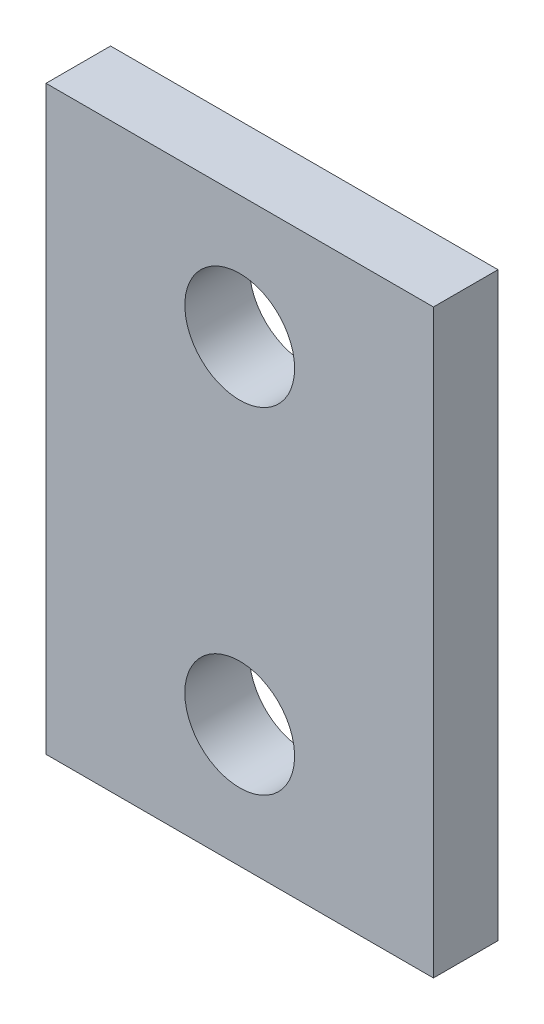
ISO-10303-21;
HEADER;
FILE_DESCRIPTION(('STEP AP214'),'2;1');
FILE_NAME('part.step','',(''),(''),'','','');
FILE_SCHEMA(('AUTOMOTIVE_DESIGN { 1 0 10303 214 1 1 1 1 }'));
ENDSEC;
DATA;
#1=APPLICATION_CONTEXT('core data for automotive mechanical design processes');
#2=APPLICATION_PROTOCOL_DEFINITION('international standard','automotive_design',2000,#1);
#3=PRODUCT_CONTEXT('',#1,'mechanical');
#4=PRODUCT('Part','Part','',(#3));
#5=PRODUCT_RELATED_PRODUCT_CATEGORY('part','',(#4));
#6=PRODUCT_DEFINITION_FORMATION('','',#4);
#7=PRODUCT_DEFINITION_CONTEXT('part definition',#1,'design');
#8=PRODUCT_DEFINITION('design','',#6,#7);
#9=PRODUCT_DEFINITION_SHAPE('','',#8);
#10=(LENGTH_UNIT() NAMED_UNIT(*) SI_UNIT(.MILLI.,.METRE.));
#11=(NAMED_UNIT(*) PLANE_ANGLE_UNIT() SI_UNIT($,.RADIAN.));
#12=(NAMED_UNIT(*) SI_UNIT($,.STERADIAN.) SOLID_ANGLE_UNIT());
#13=UNCERTAINTY_MEASURE_WITH_UNIT(LENGTH_MEASURE(1.E-05),#10,'distance_accuracy_value','');
#14=(GEOMETRIC_REPRESENTATION_CONTEXT(3) GLOBAL_UNCERTAINTY_ASSIGNED_CONTEXT((#13)) GLOBAL_UNIT_ASSIGNED_CONTEXT((#10,
#11,#12)) REPRESENTATION_CONTEXT('',''));
#15=CARTESIAN_POINT('',(0.,0.,0.));
#16=DIRECTION('',(0.,0.,1.));
#17=DIRECTION('',(1.,0.,0.));
#18=AXIS2_PLACEMENT_3D('',#15,#16,#17);
#19=CARTESIAN_POINT('',(0.,0.,5.));
#20=DIRECTION('',(0.,0.,-1.));
#21=DIRECTION('',(-1.,0.,0.));
#22=AXIS2_PLACEMENT_3D('',#19,#20,#21);
#23=PLANE('',#22);
#24=DIRECTION('',(0.,-1.,0.));
#25=VECTOR('',#24,1.);
#26=CARTESIAN_POINT('',(-15.,22.5,5.));
#27=LINE('',#26,#25);
#28=CARTESIAN_POINT('',(-15.,22.5,5.));
#29=VERTEX_POINT('',#28);
#30=CARTESIAN_POINT('',(-15.,-22.5,5.));
#31=VERTEX_POINT('',#30);
#32=EDGE_CURVE('E87',#29,#31,#27,.T.);
#33=ORIENTED_EDGE('',*,*,#32,.T.);
#34=DIRECTION('',(1.,0.,0.));
#35=VECTOR('',#34,1.);
#36=CARTESIAN_POINT('',(15.,-22.5,5.));
#37=LINE('',#36,#35);
#38=CARTESIAN_POINT('',(15.,-22.5,5.));
#39=VERTEX_POINT('',#38);
#40=EDGE_CURVE('E82',#31,#39,#37,.T.);
#41=ORIENTED_EDGE('',*,*,#40,.T.);
#42=DIRECTION('',(0.,1.,0.));
#43=VECTOR('',#42,1.);
#44=CARTESIAN_POINT('',(15.,22.5,5.));
#45=LINE('',#44,#43);
#46=CARTESIAN_POINT('',(15.,22.5,5.));
#47=VERTEX_POINT('',#46);
#48=EDGE_CURVE('E85',#39,#47,#45,.T.);
#49=ORIENTED_EDGE('',*,*,#48,.T.);
#50=DIRECTION('',(-1.,0.,0.));
#51=VECTOR('',#50,1.);
#52=CARTESIAN_POINT('',(15.,22.5,5.));
#53=LINE('',#52,#51);
#54=EDGE_CURVE('E52',#47,#29,#53,.T.);
#55=ORIENTED_EDGE('',*,*,#54,.T.);
#56=EDGE_LOOP('',(#33,#41,#49,#55));
#57=FACE_BOUND('',#56,.T.);
#58=CARTESIAN_POINT('',(0.,13.,5.));
#59=DIRECTION('',(0.,0.,1.));
#60=DIRECTION('',(1.,0.,0.));
#61=AXIS2_PLACEMENT_3D('',#58,#59,#60);
#62=CIRCLE('',#61,4.25);
#63=CARTESIAN_POINT('',(4.25,13.,5.));
#64=VERTEX_POINT('',#63);
#65=EDGE_CURVE('E102',#64,#64,#62,.T.);
#66=ORIENTED_EDGE('',*,*,#65,.F.);
#67=EDGE_LOOP('',(#66));
#68=FACE_BOUND('',#67,.T.);
#69=CARTESIAN_POINT('',(0.,-13.,5.));
#70=DIRECTION('',(0.,0.,1.));
#71=DIRECTION('',(-1.,0.,0.));
#72=AXIS2_PLACEMENT_3D('',#69,#70,#71);
#73=CIRCLE('',#72,4.25);
#74=CARTESIAN_POINT('',(-4.25,-13.,5.));
#75=VERTEX_POINT('',#74);
#76=EDGE_CURVE('E117',#75,#75,#73,.T.);
#77=ORIENTED_EDGE('',*,*,#76,.F.);
#78=EDGE_LOOP('',(#77));
#79=FACE_BOUND('',#78,.T.);
#80=ADVANCED_FACE('F35',(#57,#68,#79),#23,.F.);
#81=CARTESIAN_POINT('',(0.,0.,0.));
#82=DIRECTION('',(0.,0.,-1.));
#83=DIRECTION('',(-1.,0.,0.));
#84=AXIS2_PLACEMENT_3D('',#81,#82,#83);
#85=PLANE('',#84);
#86=CARTESIAN_POINT('',(0.,13.,0.));
#87=DIRECTION('',(0.,0.,1.));
#88=DIRECTION('',(1.,0.,0.));
#89=AXIS2_PLACEMENT_3D('',#86,#87,#88);
#90=CIRCLE('',#89,4.25);
#91=CARTESIAN_POINT('',(4.25,13.,0.));
#92=VERTEX_POINT('',#91);
#93=EDGE_CURVE('E114',#92,#92,#90,.T.);
#94=ORIENTED_EDGE('',*,*,#93,.T.);
#95=EDGE_LOOP('',(#94));
#96=FACE_BOUND('',#95,.T.);
#97=DIRECTION('',(0.,-1.,0.));
#98=VECTOR('',#97,1.);
#99=CARTESIAN_POINT('',(-15.,22.5,0.));
#100=LINE('',#99,#98);
#101=CARTESIAN_POINT('',(-15.,22.5,0.));
#102=VERTEX_POINT('',#101);
#103=CARTESIAN_POINT('',(-15.,-22.5,0.));
#104=VERTEX_POINT('',#103);
#105=EDGE_CURVE('E99',#102,#104,#100,.T.);
#106=ORIENTED_EDGE('',*,*,#105,.F.);
#107=DIRECTION('',(-1.,0.,0.));
#108=VECTOR('',#107,1.);
#109=CARTESIAN_POINT('',(15.,22.5,0.));
#110=LINE('',#109,#108);
#111=CARTESIAN_POINT('',(15.,22.5,0.));
#112=VERTEX_POINT('',#111);
#113=EDGE_CURVE('E75',#112,#102,#110,.T.);
#114=ORIENTED_EDGE('',*,*,#113,.F.);
#115=DIRECTION('',(0.,1.,0.));
#116=VECTOR('',#115,1.);
#117=CARTESIAN_POINT('',(15.,22.5,0.));
#118=LINE('',#117,#116);
#119=CARTESIAN_POINT('',(15.,-22.5,0.));
#120=VERTEX_POINT('',#119);
#121=EDGE_CURVE('E69',#120,#112,#118,.T.);
#122=ORIENTED_EDGE('',*,*,#121,.F.);
#123=DIRECTION('',(1.,0.,0.));
#124=VECTOR('',#123,1.);
#125=CARTESIAN_POINT('',(15.,-22.5,0.));
#126=LINE('',#125,#124);
#127=EDGE_CURVE('E91',#104,#120,#126,.T.);
#128=ORIENTED_EDGE('',*,*,#127,.F.);
#129=EDGE_LOOP('',(#106,#114,#122,#128));
#130=FACE_BOUND('',#129,.T.);
#131=CARTESIAN_POINT('',(0.,-13.,0.));
#132=DIRECTION('',(0.,0.,1.));
#133=DIRECTION('',(-1.,0.,0.));
#134=AXIS2_PLACEMENT_3D('',#131,#132,#133);
#135=CIRCLE('',#134,4.25);
#136=CARTESIAN_POINT('',(-4.25,-13.,0.));
#137=VERTEX_POINT('',#136);
#138=EDGE_CURVE('E120',#137,#137,#135,.T.);
#139=ORIENTED_EDGE('',*,*,#138,.T.);
#140=EDGE_LOOP('',(#139));
#141=FACE_BOUND('',#140,.T.);
#142=ADVANCED_FACE('F110',(#96,#130,#141),#85,.T.);
#143=CARTESIAN_POINT('',(-15.,22.5,5.));
#144=DIRECTION('',(1.,0.,0.));
#145=DIRECTION('',(0.,1.,0.));
#146=AXIS2_PLACEMENT_3D('',#143,#144,#145);
#147=PLANE('',#146);
#148=ORIENTED_EDGE('',*,*,#105,.T.);
#149=DIRECTION('',(0.,0.,-1.));
#150=VECTOR('',#149,1.);
#151=CARTESIAN_POINT('',(-15.,-22.5,5.));
#152=LINE('',#151,#150);
#153=EDGE_CURVE('E11',#31,#104,#152,.T.);
#154=ORIENTED_EDGE('',*,*,#153,.F.);
#155=ORIENTED_EDGE('',*,*,#32,.F.);
#156=DIRECTION('',(0.,0.,-1.));
#157=VECTOR('',#156,1.);
#158=CARTESIAN_POINT('',(-15.,22.5,5.));
#159=LINE('',#158,#157);
#160=EDGE_CURVE('E95',#29,#102,#159,.T.);
#161=ORIENTED_EDGE('',*,*,#160,.T.);
#162=EDGE_LOOP('',(#148,#154,#155,#161));
#163=FACE_BOUND('',#162,.T.);
#164=ADVANCED_FACE('F37',(#163),#147,.F.);
#165=CARTESIAN_POINT('',(15.,-22.5,5.));
#166=DIRECTION('',(0.,1.,0.));
#167=DIRECTION('',(-1.,0.,0.));
#168=AXIS2_PLACEMENT_3D('',#165,#166,#167);
#169=PLANE('',#168);
#170=ORIENTED_EDGE('',*,*,#127,.T.);
#171=DIRECTION('',(0.,0.,-1.));
#172=VECTOR('',#171,1.);
#173=CARTESIAN_POINT('',(15.,-22.5,5.));
#174=LINE('',#173,#172);
#175=EDGE_CURVE('E44',#39,#120,#174,.T.);
#176=ORIENTED_EDGE('',*,*,#175,.F.);
#177=ORIENTED_EDGE('',*,*,#40,.F.);
#178=ORIENTED_EDGE('',*,*,#153,.T.);
#179=EDGE_LOOP('',(#170,#176,#177,#178));
#180=FACE_BOUND('',#179,.T.);
#181=ADVANCED_FACE('F90',(#180),#169,.F.);
#182=CARTESIAN_POINT('',(15.,22.5,5.));
#183=DIRECTION('',(-1.,0.,0.));
#184=DIRECTION('',(0.,-1.,0.));
#185=AXIS2_PLACEMENT_3D('',#182,#183,#184);
#186=PLANE('',#185);
#187=ORIENTED_EDGE('',*,*,#121,.T.);
#188=DIRECTION('',(0.,0.,-1.));
#189=VECTOR('',#188,1.);
#190=CARTESIAN_POINT('',(15.,22.5,5.));
#191=LINE('',#190,#189);
#192=EDGE_CURVE('E92',#47,#112,#191,.T.);
#193=ORIENTED_EDGE('',*,*,#192,.F.);
#194=ORIENTED_EDGE('',*,*,#48,.F.);
#195=ORIENTED_EDGE('',*,*,#175,.T.);
#196=EDGE_LOOP('',(#187,#193,#194,#195));
#197=FACE_BOUND('',#196,.T.);
#198=ADVANCED_FACE('F93',(#197),#186,.F.);
#199=CARTESIAN_POINT('',(15.,22.5,5.));
#200=DIRECTION('',(0.,-1.,0.));
#201=DIRECTION('',(1.,0.,0.));
#202=AXIS2_PLACEMENT_3D('',#199,#200,#201);
#203=PLANE('',#202);
#204=ORIENTED_EDGE('',*,*,#113,.T.);
#205=ORIENTED_EDGE('',*,*,#160,.F.);
#206=ORIENTED_EDGE('',*,*,#54,.F.);
#207=ORIENTED_EDGE('',*,*,#192,.T.);
#208=EDGE_LOOP('',(#204,#205,#206,#207));
#209=FACE_BOUND('',#208,.T.);
#210=ADVANCED_FACE('F107',(#209),#203,.F.);
#211=CARTESIAN_POINT('',(0.,13.,5.));
#212=DIRECTION('',(0.,0.,-1.));
#213=DIRECTION('',(-1.,0.,0.));
#214=AXIS2_PLACEMENT_3D('',#211,#212,#213);
#215=CYLINDRICAL_SURFACE('',#214,4.25);
#216=ORIENTED_EDGE('',*,*,#65,.T.);
#217=EDGE_LOOP('',(#216));
#218=FACE_BOUND('',#217,.T.);
#219=ORIENTED_EDGE('',*,*,#93,.F.);
#220=EDGE_LOOP('',(#219));
#221=FACE_BOUND('',#220,.T.);
#222=ADVANCED_FACE('F137',(#218,#221),#215,.F.);
#223=CARTESIAN_POINT('',(0.,-13.,5.));
#224=DIRECTION('',(0.,0.,-1.));
#225=DIRECTION('',(-1.,0.,0.));
#226=AXIS2_PLACEMENT_3D('',#223,#224,#225);
#227=CYLINDRICAL_SURFACE('',#226,4.25);
#228=ORIENTED_EDGE('',*,*,#76,.T.);
#229=EDGE_LOOP('',(#228));
#230=FACE_BOUND('',#229,.T.);
#231=ORIENTED_EDGE('',*,*,#138,.F.);
#232=EDGE_LOOP('',(#231));
#233=FACE_BOUND('',#232,.T.);
#234=ADVANCED_FACE('F126',(#230,#233),#227,.F.);
#235=CLOSED_SHELL('',(#80,#142,#164,#181,#198,#210,#222,#234));
#236=MANIFOLD_SOLID_BREP('B2',#235);
#237=ADVANCED_BREP_SHAPE_REPRESENTATION('',(#18,#236),#14);
#238=SHAPE_DEFINITION_REPRESENTATION(#9,#237);
ENDSEC;
END-ISO-10303-21;
